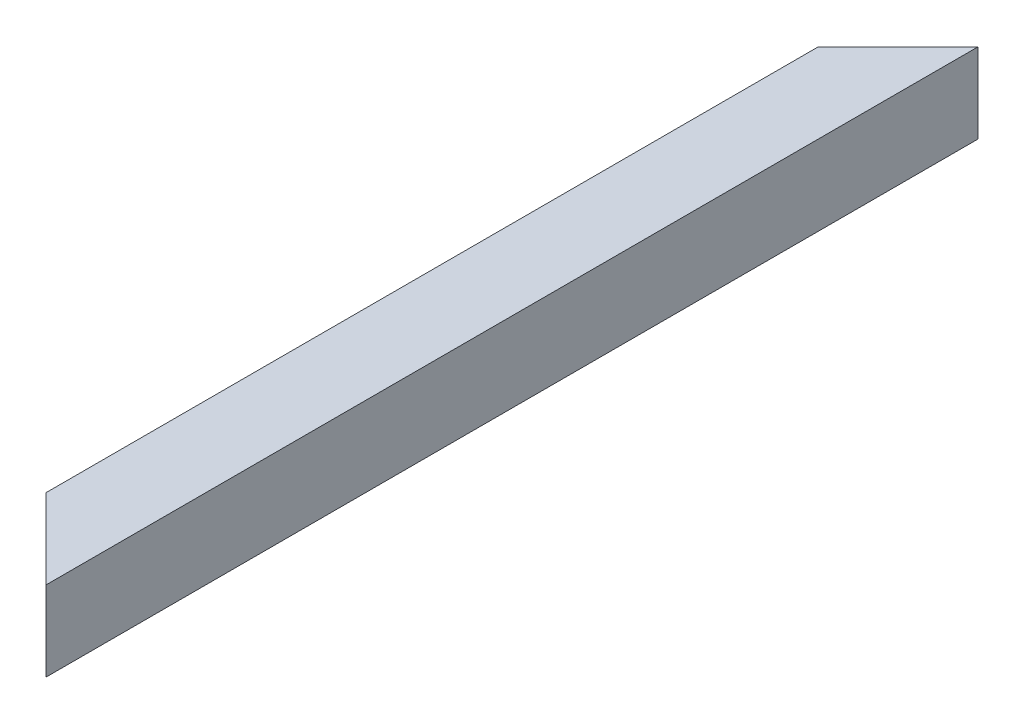
ISO-10303-21;
HEADER;
FILE_DESCRIPTION(('STEP AP214'),'2;1');
FILE_NAME('part.step','',(''),(''),'','','');
FILE_SCHEMA(('AUTOMOTIVE_DESIGN { 1 0 10303 214 1 1 1 1 }'));
ENDSEC;
DATA;
#1=APPLICATION_CONTEXT('core data for automotive mechanical design processes');
#2=APPLICATION_PROTOCOL_DEFINITION('international standard','automotive_design',2000,#1);
#3=PRODUCT_CONTEXT('',#1,'mechanical');
#4=PRODUCT('Part','Part','',(#3));
#5=PRODUCT_RELATED_PRODUCT_CATEGORY('part','',(#4));
#6=PRODUCT_DEFINITION_FORMATION('','',#4);
#7=PRODUCT_DEFINITION_CONTEXT('part definition',#1,'design');
#8=PRODUCT_DEFINITION('design','',#6,#7);
#9=PRODUCT_DEFINITION_SHAPE('','',#8);
#10=(LENGTH_UNIT() NAMED_UNIT(*) SI_UNIT(.MILLI.,.METRE.));
#11=(NAMED_UNIT(*) PLANE_ANGLE_UNIT() SI_UNIT($,.RADIAN.));
#12=(NAMED_UNIT(*) SI_UNIT($,.STERADIAN.) SOLID_ANGLE_UNIT());
#13=UNCERTAINTY_MEASURE_WITH_UNIT(LENGTH_MEASURE(1.E-05),#10,'distance_accuracy_value','');
#14=(GEOMETRIC_REPRESENTATION_CONTEXT(3) GLOBAL_UNCERTAINTY_ASSIGNED_CONTEXT((#13)) GLOBAL_UNIT_ASSIGNED_CONTEXT((#10,
#11,#12)) REPRESENTATION_CONTEXT('',''));
#15=CARTESIAN_POINT('',(0.,0.,0.));
#16=DIRECTION('',(0.,0.,1.));
#17=DIRECTION('',(1.,0.,0.));
#18=AXIS2_PLACEMENT_3D('',#15,#16,#17);
#19=CARTESIAN_POINT('',(-26.,26.,0.));
#20=DIRECTION('',(1.,0.,0.));
#21=DIRECTION('',(0.,0.,-1.));
#22=AXIS2_PLACEMENT_3D('',#19,#20,#21);
#23=PLANE('',#22);
#24=DIRECTION('',(0.,-1.,0.));
#25=VECTOR('',#24,1.);
#26=CARTESIAN_POINT('',(-26.,26.,55.9999999999994));
#27=LINE('',#26,#25);
#28=CARTESIAN_POINT('',(-26.,26.,55.9999999999994));
#29=VERTEX_POINT('',#28);
#30=CARTESIAN_POINT('',(-26.,-26.,55.9999999999994));
#31=VERTEX_POINT('',#30);
#32=EDGE_CURVE('E11',#29,#31,#27,.T.);
#33=ORIENTED_EDGE('',*,*,#32,.F.);
#34=DIRECTION('',(0.,0.,1.));
#35=VECTOR('',#34,1.);
#36=CARTESIAN_POINT('',(-26.,26.,0.));
#37=LINE('',#36,#35);
#38=CARTESIAN_POINT('',(-26.,26.,644.));
#39=VERTEX_POINT('',#38);
#40=EDGE_CURVE('E145',#29,#39,#37,.T.);
#41=ORIENTED_EDGE('',*,*,#40,.T.);
#42=DIRECTION('',(0.,1.,0.));
#43=VECTOR('',#42,1.);
#44=CARTESIAN_POINT('',(-26.,26.,644.));
#45=LINE('',#44,#43);
#46=CARTESIAN_POINT('',(-26.,-26.,644.));
#47=VERTEX_POINT('',#46);
#48=EDGE_CURVE('E43',#47,#39,#45,.T.);
#49=ORIENTED_EDGE('',*,*,#48,.F.);
#50=DIRECTION('',(0.,0.,1.));
#51=VECTOR('',#50,1.);
#52=CARTESIAN_POINT('',(-26.,-26.,0.));
#53=LINE('',#52,#51);
#54=EDGE_CURVE('E132',#31,#47,#53,.T.);
#55=ORIENTED_EDGE('',*,*,#54,.F.);
#56=EDGE_LOOP('',(#33,#41,#49,#55));
#57=FACE_BOUND('',#56,.T.);
#58=ADVANCED_FACE('F35',(#57),#23,.T.);
#59=CARTESIAN_POINT('',(-26.,-26.,0.));
#60=DIRECTION('',(0.,1.,0.));
#61=DIRECTION('',(0.,0.,1.));
#62=AXIS2_PLACEMENT_3D('',#59,#60,#61);
#63=PLANE('',#62);
#64=DIRECTION('',(0.707106781186551,0.,-0.707106781186544));
#65=VECTOR('',#64,1.);
#66=CARTESIAN_POINT('',(1.9999999999997,-26.,28.));
#67=LINE('',#66,#65);
#68=CARTESIAN_POINT('',(26.,-26.,3.99999999999995));
#69=VERTEX_POINT('',#68);
#70=EDGE_CURVE('E165',#31,#69,#67,.T.);
#71=ORIENTED_EDGE('',*,*,#70,.F.);
#72=ORIENTED_EDGE('',*,*,#54,.T.);
#73=DIRECTION('',(-0.707106781186551,0.,-0.707106781186544));
#74=VECTOR('',#73,1.);
#75=CARTESIAN_POINT('',(-348.,-26.,322.000000000004));
#76=LINE('',#75,#74);
#77=CARTESIAN_POINT('',(26.,-26.,696.));
#78=VERTEX_POINT('',#77);
#79=EDGE_CURVE('E57',#78,#47,#76,.T.);
#80=ORIENTED_EDGE('',*,*,#79,.F.);
#81=DIRECTION('',(0.,0.,1.));
#82=VECTOR('',#81,1.);
#83=CARTESIAN_POINT('',(26.,-26.,0.));
#84=LINE('',#83,#82);
#85=EDGE_CURVE('E135',#69,#78,#84,.T.);
#86=ORIENTED_EDGE('',*,*,#85,.F.);
#87=EDGE_LOOP('',(#71,#72,#80,#86));
#88=FACE_BOUND('',#87,.T.);
#89=ADVANCED_FACE('F181',(#88),#63,.T.);
#90=CARTESIAN_POINT('',(26.,26.,0.));
#91=DIRECTION('',(-1.,0.,0.));
#92=DIRECTION('',(0.,0.,1.));
#93=AXIS2_PLACEMENT_3D('',#90,#91,#92);
#94=PLANE('',#93);
#95=DIRECTION('',(0.,1.,0.));
#96=VECTOR('',#95,1.);
#97=CARTESIAN_POINT('',(26.,26.,3.99999999999995));
#98=LINE('',#97,#96);
#99=CARTESIAN_POINT('',(26.,26.,3.99999999999995));
#100=VERTEX_POINT('',#99);
#101=EDGE_CURVE('E167',#69,#100,#98,.T.);
#102=ORIENTED_EDGE('',*,*,#101,.F.);
#103=ORIENTED_EDGE('',*,*,#85,.T.);
#104=DIRECTION('',(0.,-1.,0.));
#105=VECTOR('',#104,1.);
#106=CARTESIAN_POINT('',(26.,26.,696.));
#107=LINE('',#106,#105);
#108=CARTESIAN_POINT('',(26.,26.,696.));
#109=VERTEX_POINT('',#108);
#110=EDGE_CURVE('E161',#109,#78,#107,.T.);
#111=ORIENTED_EDGE('',*,*,#110,.F.);
#112=DIRECTION('',(0.,0.,1.));
#113=VECTOR('',#112,1.);
#114=CARTESIAN_POINT('',(26.,26.,0.));
#115=LINE('',#114,#113);
#116=EDGE_CURVE('E141',#100,#109,#115,.T.);
#117=ORIENTED_EDGE('',*,*,#116,.F.);
#118=EDGE_LOOP('',(#102,#103,#111,#117));
#119=FACE_BOUND('',#118,.T.);
#120=ADVANCED_FACE('F178',(#119),#94,.T.);
#121=CARTESIAN_POINT('',(-26.,26.,0.));
#122=DIRECTION('',(0.,-1.,0.));
#123=DIRECTION('',(0.,0.,-1.));
#124=AXIS2_PLACEMENT_3D('',#121,#122,#123);
#125=PLANE('',#124);
#126=DIRECTION('',(-0.707106781186551,0.,0.707106781186544));
#127=VECTOR('',#126,1.);
#128=CARTESIAN_POINT('',(1.9999999999997,26.,28.));
#129=LINE('',#128,#127);
#130=EDGE_CURVE('E49',#100,#29,#129,.T.);
#131=ORIENTED_EDGE('',*,*,#130,.F.);
#132=ORIENTED_EDGE('',*,*,#116,.T.);
#133=DIRECTION('',(0.707106781186551,0.,0.707106781186544));
#134=VECTOR('',#133,1.);
#135=CARTESIAN_POINT('',(-348.,26.,322.000000000004));
#136=LINE('',#135,#134);
#137=EDGE_CURVE('E163',#39,#109,#136,.T.);
#138=ORIENTED_EDGE('',*,*,#137,.F.);
#139=ORIENTED_EDGE('',*,*,#40,.F.);
#140=EDGE_LOOP('',(#131,#132,#138,#139));
#141=FACE_BOUND('',#140,.T.);
#142=ADVANCED_FACE('F173',(#141),#125,.T.);
#143=CARTESIAN_POINT('',(30.,-30.,700.));
#144=DIRECTION('',(0.707106781186544,0.,-0.707106781186551));
#145=DIRECTION('',(-0.707106781186551,0.,-0.707106781186544));
#146=AXIS2_PLACEMENT_3D('',#143,#144,#145);
#147=PLANE('',#146);
#148=ORIENTED_EDGE('',*,*,#137,.T.);
#149=ORIENTED_EDGE('',*,*,#110,.T.);
#150=ORIENTED_EDGE('',*,*,#79,.T.);
#151=ORIENTED_EDGE('',*,*,#48,.T.);
#152=EDGE_LOOP('',(#148,#149,#150,#151));
#153=FACE_BOUND('',#152,.T.);
#154=DIRECTION('',(-0.707106781186551,0.,-0.707106781186544));
#155=VECTOR('',#154,1.);
#156=CARTESIAN_POINT('',(30.,30.,700.));
#157=LINE('',#156,#155);
#158=CARTESIAN_POINT('',(30.,30.,700.));
#159=VERTEX_POINT('',#158);
#160=CARTESIAN_POINT('',(-30.,30.,640.000000000001));
#161=VERTEX_POINT('',#160);
#162=EDGE_CURVE('E154',#159,#161,#157,.T.);
#163=ORIENTED_EDGE('',*,*,#162,.T.);
#164=DIRECTION('',(0.,1.,0.));
#165=VECTOR('',#164,1.);
#166=CARTESIAN_POINT('',(-30.,-30.,640.000000000001));
#167=LINE('',#166,#165);
#168=CARTESIAN_POINT('',(-30.,-30.,640.000000000001));
#169=VERTEX_POINT('',#168);
#170=EDGE_CURVE('E156',#169,#161,#167,.T.);
#171=ORIENTED_EDGE('',*,*,#170,.F.);
#172=DIRECTION('',(-0.707106781186551,0.,-0.707106781186544));
#173=VECTOR('',#172,1.);
#174=CARTESIAN_POINT('',(30.,-30.,700.));
#175=LINE('',#174,#173);
#176=CARTESIAN_POINT('',(30.,-30.,700.));
#177=VERTEX_POINT('',#176);
#178=EDGE_CURVE('E122',#177,#169,#175,.T.);
#179=ORIENTED_EDGE('',*,*,#178,.F.);
#180=DIRECTION('',(0.,1.,0.));
#181=VECTOR('',#180,1.);
#182=CARTESIAN_POINT('',(30.,30.,700.));
#183=LINE('',#182,#181);
#184=EDGE_CURVE('E144',#177,#159,#183,.T.);
#185=ORIENTED_EDGE('',*,*,#184,.T.);
#186=EDGE_LOOP('',(#163,#171,#179,#185));
#187=FACE_BOUND('',#186,.T.);
#188=ADVANCED_FACE('F180',(#153,#187),#147,.F.);
#189=CARTESIAN_POINT('',(30.,-30.,0.));
#190=DIRECTION('',(0.707106781186544,0.,0.707106781186551));
#191=DIRECTION('',(0.707106781186551,0.,-0.707106781186544));
#192=AXIS2_PLACEMENT_3D('',#189,#190,#191);
#193=PLANE('',#192);
#194=ORIENTED_EDGE('',*,*,#130,.T.);
#195=ORIENTED_EDGE('',*,*,#32,.T.);
#196=ORIENTED_EDGE('',*,*,#70,.T.);
#197=ORIENTED_EDGE('',*,*,#101,.T.);
#198=EDGE_LOOP('',(#194,#195,#196,#197));
#199=FACE_BOUND('',#198,.T.);
#200=DIRECTION('',(0.707106781186551,0.,-0.707106781186544));
#201=VECTOR('',#200,1.);
#202=CARTESIAN_POINT('',(30.,30.,0.));
#203=LINE('',#202,#201);
#204=CARTESIAN_POINT('',(-30.,30.,59.9999999999994));
#205=VERTEX_POINT('',#204);
#206=CARTESIAN_POINT('',(30.,30.,0.));
#207=VERTEX_POINT('',#206);
#208=EDGE_CURVE('E109',#205,#207,#203,.T.);
#209=ORIENTED_EDGE('',*,*,#208,.T.);
#210=DIRECTION('',(0.,1.,0.));
#211=VECTOR('',#210,1.);
#212=CARTESIAN_POINT('',(30.,30.,0.));
#213=LINE('',#212,#211);
#214=CARTESIAN_POINT('',(30.,-30.,0.));
#215=VERTEX_POINT('',#214);
#216=EDGE_CURVE('E104',#215,#207,#213,.T.);
#217=ORIENTED_EDGE('',*,*,#216,.F.);
#218=DIRECTION('',(0.707106781186551,0.,-0.707106781186544));
#219=VECTOR('',#218,1.);
#220=CARTESIAN_POINT('',(30.,-30.,0.));
#221=LINE('',#220,#219);
#222=CARTESIAN_POINT('',(-30.,-30.,59.9999999999994));
#223=VERTEX_POINT('',#222);
#224=EDGE_CURVE('E98',#223,#215,#221,.T.);
#225=ORIENTED_EDGE('',*,*,#224,.F.);
#226=DIRECTION('',(0.,1.,0.));
#227=VECTOR('',#226,1.);
#228=CARTESIAN_POINT('',(-30.,-30.,59.9999999999994));
#229=LINE('',#228,#227);
#230=EDGE_CURVE('E101',#223,#205,#229,.T.);
#231=ORIENTED_EDGE('',*,*,#230,.T.);
#232=EDGE_LOOP('',(#209,#217,#225,#231));
#233=FACE_BOUND('',#232,.T.);
#234=ADVANCED_FACE('F100',(#199,#233),#193,.F.);
#235=CARTESIAN_POINT('',(-30.,30.,0.));
#236=DIRECTION('',(-1.,0.,0.));
#237=DIRECTION('',(0.,0.,1.));
#238=AXIS2_PLACEMENT_3D('',#235,#236,#237);
#239=PLANE('',#238);
#240=ORIENTED_EDGE('',*,*,#230,.F.);
#241=DIRECTION('',(0.,0.,1.));
#242=VECTOR('',#241,1.);
#243=CARTESIAN_POINT('',(-30.,-30.,0.));
#244=LINE('',#243,#242);
#245=EDGE_CURVE('E116',#223,#169,#244,.T.);
#246=ORIENTED_EDGE('',*,*,#245,.T.);
#247=ORIENTED_EDGE('',*,*,#170,.T.);
#248=DIRECTION('',(0.,0.,1.));
#249=VECTOR('',#248,1.);
#250=CARTESIAN_POINT('',(-30.,30.,0.));
#251=LINE('',#250,#249);
#252=EDGE_CURVE('E118',#205,#161,#251,.T.);
#253=ORIENTED_EDGE('',*,*,#252,.F.);
#254=EDGE_LOOP('',(#240,#246,#247,#253));
#255=FACE_BOUND('',#254,.T.);
#256=ADVANCED_FACE('F114',(#255),#239,.T.);
#257=CARTESIAN_POINT('',(-30.,-30.,0.));
#258=DIRECTION('',(0.,-1.,0.));
#259=DIRECTION('',(0.,0.,-1.));
#260=AXIS2_PLACEMENT_3D('',#257,#258,#259);
#261=PLANE('',#260);
#262=ORIENTED_EDGE('',*,*,#224,.T.);
#263=DIRECTION('',(0.,0.,1.));
#264=VECTOR('',#263,1.);
#265=CARTESIAN_POINT('',(30.,-30.,0.));
#266=LINE('',#265,#264);
#267=EDGE_CURVE('E123',#215,#177,#266,.T.);
#268=ORIENTED_EDGE('',*,*,#267,.T.);
#269=ORIENTED_EDGE('',*,*,#178,.T.);
#270=ORIENTED_EDGE('',*,*,#245,.F.);
#271=EDGE_LOOP('',(#262,#268,#269,#270));
#272=FACE_BOUND('',#271,.T.);
#273=ADVANCED_FACE('F121',(#272),#261,.T.);
#274=CARTESIAN_POINT('',(30.,30.,0.));
#275=DIRECTION('',(1.,0.,0.));
#276=DIRECTION('',(0.,0.,-1.));
#277=AXIS2_PLACEMENT_3D('',#274,#275,#276);
#278=PLANE('',#277);
#279=DIRECTION('',(0.,0.,1.));
#280=VECTOR('',#279,1.);
#281=CARTESIAN_POINT('',(30.,30.,0.));
#282=LINE('',#281,#280);
#283=EDGE_CURVE('E125',#207,#159,#282,.T.);
#284=ORIENTED_EDGE('',*,*,#283,.T.);
#285=ORIENTED_EDGE('',*,*,#184,.F.);
#286=ORIENTED_EDGE('',*,*,#267,.F.);
#287=ORIENTED_EDGE('',*,*,#216,.T.);
#288=EDGE_LOOP('',(#284,#285,#286,#287));
#289=FACE_BOUND('',#288,.T.);
#290=ADVANCED_FACE('F152',(#289),#278,.T.);
#291=CARTESIAN_POINT('',(-30.,30.,0.));
#292=DIRECTION('',(0.,1.,0.));
#293=DIRECTION('',(0.,0.,1.));
#294=AXIS2_PLACEMENT_3D('',#291,#292,#293);
#295=PLANE('',#294);
#296=ORIENTED_EDGE('',*,*,#208,.F.);
#297=ORIENTED_EDGE('',*,*,#252,.T.);
#298=ORIENTED_EDGE('',*,*,#162,.F.);
#299=ORIENTED_EDGE('',*,*,#283,.F.);
#300=EDGE_LOOP('',(#296,#297,#298,#299));
#301=FACE_BOUND('',#300,.T.);
#302=ADVANCED_FACE('F37',(#301),#295,.T.);
#303=CLOSED_SHELL('',(#58,#89,#120,#142,#188,#234,#256,#273,#290,#302));
#304=MANIFOLD_SOLID_BREP('B2',#303);
#305=ADVANCED_BREP_SHAPE_REPRESENTATION('',(#18,#304),#14);
#306=SHAPE_DEFINITION_REPRESENTATION(#9,#305);
ENDSEC;
END-ISO-10303-21;
